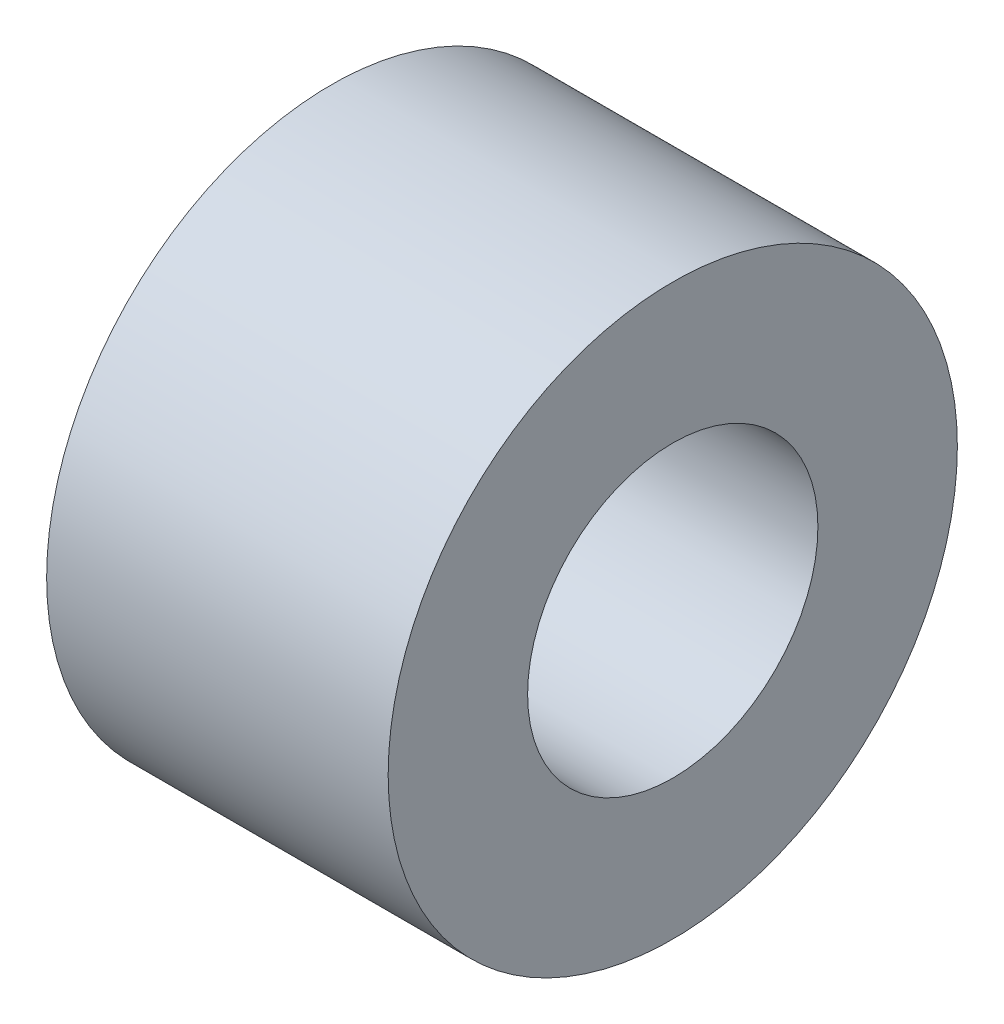
ISO-10303-21;
HEADER;
FILE_DESCRIPTION(('STEP AP214'),'2;1');
FILE_NAME('part.step','',(''),(''),'','','');
FILE_SCHEMA(('AUTOMOTIVE_DESIGN { 1 0 10303 214 1 1 1 1 }'));
ENDSEC;
DATA;
#1=APPLICATION_CONTEXT('core data for automotive mechanical design processes');
#2=APPLICATION_PROTOCOL_DEFINITION('international standard','automotive_design',2000,#1);
#3=PRODUCT_CONTEXT('',#1,'mechanical');
#4=PRODUCT('Part','Part','',(#3));
#5=PRODUCT_RELATED_PRODUCT_CATEGORY('part','',(#4));
#6=PRODUCT_DEFINITION_FORMATION('','',#4);
#7=PRODUCT_DEFINITION_CONTEXT('part definition',#1,'design');
#8=PRODUCT_DEFINITION('design','',#6,#7);
#9=PRODUCT_DEFINITION_SHAPE('','',#8);
#10=(LENGTH_UNIT() NAMED_UNIT(*) SI_UNIT(.MILLI.,.METRE.));
#11=(NAMED_UNIT(*) PLANE_ANGLE_UNIT() SI_UNIT($,.RADIAN.));
#12=(NAMED_UNIT(*) SI_UNIT($,.STERADIAN.) SOLID_ANGLE_UNIT());
#13=UNCERTAINTY_MEASURE_WITH_UNIT(LENGTH_MEASURE(1.E-05),#10,'distance_accuracy_value','');
#14=(GEOMETRIC_REPRESENTATION_CONTEXT(3) GLOBAL_UNCERTAINTY_ASSIGNED_CONTEXT((#13)) GLOBAL_UNIT_ASSIGNED_CONTEXT((#10,
#11,#12)) REPRESENTATION_CONTEXT('',''));
#15=CARTESIAN_POINT('',(0.,0.,0.));
#16=DIRECTION('',(0.,0.,1.));
#17=DIRECTION('',(1.,0.,0.));
#18=AXIS2_PLACEMENT_3D('',#15,#16,#17);
#19=CARTESIAN_POINT('',(3.,0.,0.));
#20=DIRECTION('',(1.,0.,0.));
#21=DIRECTION('',(0.,0.,-1.));
#22=AXIS2_PLACEMENT_3D('',#19,#20,#21);
#23=PLANE('',#22);
#24=CARTESIAN_POINT('',(3.,0.,0.));
#25=DIRECTION('',(1.,0.,0.));
#26=DIRECTION('',(0.,0.,-1.));
#27=AXIS2_PLACEMENT_3D('',#24,#25,#26);
#28=CIRCLE('',#27,5.);
#29=CARTESIAN_POINT('',(3.,0.,-5.));
#30=VERTEX_POINT('',#29);
#31=EDGE_CURVE('E10',#30,#30,#28,.T.);
#32=ORIENTED_EDGE('',*,*,#31,.T.);
#33=EDGE_LOOP('',(#32));
#34=FACE_BOUND('',#33,.T.);
#35=CARTESIAN_POINT('',(3.,0.,0.));
#36=DIRECTION('',(1.,0.,0.));
#37=DIRECTION('',(0.,0.,-1.));
#38=AXIS2_PLACEMENT_3D('',#35,#36,#37);
#39=CIRCLE('',#38,2.55);
#40=CARTESIAN_POINT('',(3.,0.,-2.55));
#41=VERTEX_POINT('',#40);
#42=EDGE_CURVE('E25',#41,#41,#39,.T.);
#43=ORIENTED_EDGE('',*,*,#42,.F.);
#44=EDGE_LOOP('',(#43));
#45=FACE_BOUND('',#44,.T.);
#46=ADVANCED_FACE('F14',(#34,#45),#23,.T.);
#47=CARTESIAN_POINT('',(-3.,0.,0.));
#48=DIRECTION('',(1.,0.,0.));
#49=DIRECTION('',(0.,0.,-1.));
#50=AXIS2_PLACEMENT_3D('',#47,#48,#49);
#51=PLANE('',#50);
#52=CARTESIAN_POINT('',(-3.,0.,0.));
#53=DIRECTION('',(1.,0.,0.));
#54=DIRECTION('',(0.,0.,-1.));
#55=AXIS2_PLACEMENT_3D('',#52,#53,#54);
#56=CIRCLE('',#55,5.);
#57=CARTESIAN_POINT('',(-3.,0.,-5.));
#58=VERTEX_POINT('',#57);
#59=EDGE_CURVE('E18',#58,#58,#56,.T.);
#60=ORIENTED_EDGE('',*,*,#59,.F.);
#61=EDGE_LOOP('',(#60));
#62=FACE_BOUND('',#61,.T.);
#63=CARTESIAN_POINT('',(-3.,0.,0.));
#64=DIRECTION('',(1.,0.,0.));
#65=DIRECTION('',(0.,0.,-1.));
#66=AXIS2_PLACEMENT_3D('',#63,#64,#65);
#67=CIRCLE('',#66,2.55);
#68=CARTESIAN_POINT('',(-3.,0.,-2.55));
#69=VERTEX_POINT('',#68);
#70=EDGE_CURVE('E27',#69,#69,#67,.T.);
#71=ORIENTED_EDGE('',*,*,#70,.T.);
#72=EDGE_LOOP('',(#71));
#73=FACE_BOUND('',#72,.T.);
#74=ADVANCED_FACE('F37',(#62,#73),#51,.F.);
#75=CARTESIAN_POINT('',(3.,0.,0.));
#76=DIRECTION('',(-1.,0.,0.));
#77=DIRECTION('',(0.,0.,1.));
#78=AXIS2_PLACEMENT_3D('',#75,#76,#77);
#79=CYLINDRICAL_SURFACE('',#78,5.);
#80=ORIENTED_EDGE('',*,*,#31,.F.);
#81=EDGE_LOOP('',(#80));
#82=FACE_BOUND('',#81,.T.);
#83=ORIENTED_EDGE('',*,*,#59,.T.);
#84=EDGE_LOOP('',(#83));
#85=FACE_BOUND('',#84,.T.);
#86=ADVANCED_FACE('F16',(#82,#85),#79,.T.);
#87=CARTESIAN_POINT('',(3.,0.,0.));
#88=DIRECTION('',(-1.,0.,0.));
#89=DIRECTION('',(0.,0.,1.));
#90=AXIS2_PLACEMENT_3D('',#87,#88,#89);
#91=CYLINDRICAL_SURFACE('',#90,2.55);
#92=ORIENTED_EDGE('',*,*,#42,.T.);
#93=EDGE_LOOP('',(#92));
#94=FACE_BOUND('',#93,.T.);
#95=ORIENTED_EDGE('',*,*,#70,.F.);
#96=EDGE_LOOP('',(#95));
#97=FACE_BOUND('',#96,.T.);
#98=ADVANCED_FACE('F33',(#94,#97),#91,.F.);
#99=CLOSED_SHELL('',(#46,#74,#86,#98));
#100=MANIFOLD_SOLID_BREP('B1',#99);
#101=ADVANCED_BREP_SHAPE_REPRESENTATION('',(#18,#100),#14);
#102=SHAPE_DEFINITION_REPRESENTATION(#9,#101);
ENDSEC;
END-ISO-10303-21;
